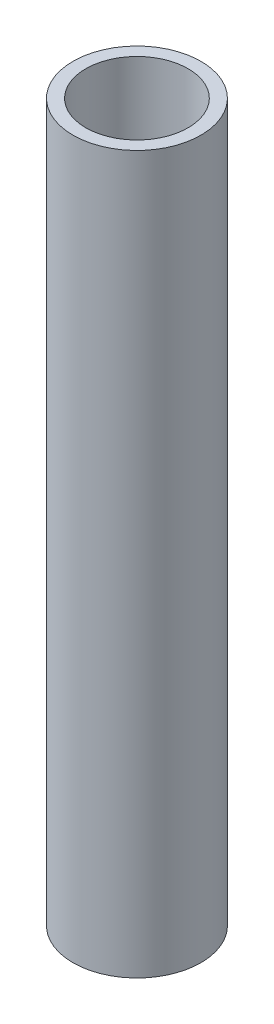
ISO-10303-21;
HEADER;
FILE_DESCRIPTION(('STEP AP214'),'2;1');
FILE_NAME('part.step','',(''),(''),'','','');
FILE_SCHEMA(('AUTOMOTIVE_DESIGN { 1 0 10303 214 1 1 1 1 }'));
ENDSEC;
DATA;
#1=APPLICATION_CONTEXT('core data for automotive mechanical design processes');
#2=APPLICATION_PROTOCOL_DEFINITION('international standard','automotive_design',2000,#1);
#3=PRODUCT_CONTEXT('',#1,'mechanical');
#4=PRODUCT('Part','Part','',(#3));
#5=PRODUCT_RELATED_PRODUCT_CATEGORY('part','',(#4));
#6=PRODUCT_DEFINITION_FORMATION('','',#4);
#7=PRODUCT_DEFINITION_CONTEXT('part definition',#1,'design');
#8=PRODUCT_DEFINITION('design','',#6,#7);
#9=PRODUCT_DEFINITION_SHAPE('','',#8);
#10=(LENGTH_UNIT() NAMED_UNIT(*) SI_UNIT(.MILLI.,.METRE.));
#11=(NAMED_UNIT(*) PLANE_ANGLE_UNIT() SI_UNIT($,.RADIAN.));
#12=(NAMED_UNIT(*) SI_UNIT($,.STERADIAN.) SOLID_ANGLE_UNIT());
#13=UNCERTAINTY_MEASURE_WITH_UNIT(LENGTH_MEASURE(1.E-05),#10,'distance_accuracy_value','');
#14=(GEOMETRIC_REPRESENTATION_CONTEXT(3) GLOBAL_UNCERTAINTY_ASSIGNED_CONTEXT((#13)) GLOBAL_UNIT_ASSIGNED_CONTEXT((#10,
#11,#12)) REPRESENTATION_CONTEXT('',''));
#15=CARTESIAN_POINT('',(0.,0.,0.));
#16=DIRECTION('',(0.,0.,1.));
#17=DIRECTION('',(1.,0.,0.));
#18=AXIS2_PLACEMENT_3D('',#15,#16,#17);
#19=CARTESIAN_POINT('',(0.,70.,0.));
#20=DIRECTION('',(0.,1.,0.));
#21=DIRECTION('',(0.,0.,1.));
#22=AXIS2_PLACEMENT_3D('',#19,#20,#21);
#23=PLANE('',#22);
#24=CARTESIAN_POINT('',(0.,70.,0.));
#25=DIRECTION('',(0.,1.,0.));
#26=DIRECTION('',(0.,0.,1.));
#27=AXIS2_PLACEMENT_3D('',#24,#25,#26);
#28=CIRCLE('',#27,12.5);
#29=CARTESIAN_POINT('',(0.,70.,12.5));
#30=VERTEX_POINT('',#29);
#31=EDGE_CURVE('E10',#30,#30,#28,.T.);
#32=ORIENTED_EDGE('',*,*,#31,.T.);
#33=EDGE_LOOP('',(#32));
#34=FACE_BOUND('',#33,.T.);
#35=CARTESIAN_POINT('',(0.,70.,0.));
#36=DIRECTION('',(0.,1.,0.));
#37=DIRECTION('',(0.,0.,1.));
#38=AXIS2_PLACEMENT_3D('',#35,#36,#37);
#39=CIRCLE('',#38,10.);
#40=CARTESIAN_POINT('',(0.,70.,10.));
#41=VERTEX_POINT('',#40);
#42=EDGE_CURVE('E46',#41,#41,#39,.T.);
#43=ORIENTED_EDGE('',*,*,#42,.F.);
#44=EDGE_LOOP('',(#43));
#45=FACE_BOUND('',#44,.T.);
#46=ADVANCED_FACE('F35',(#34,#45),#23,.T.);
#47=CARTESIAN_POINT('',(0.,-70.,0.));
#48=DIRECTION('',(0.,1.,0.));
#49=DIRECTION('',(0.,0.,1.));
#50=AXIS2_PLACEMENT_3D('',#47,#48,#49);
#51=PLANE('',#50);
#52=CARTESIAN_POINT('',(0.,-70.,0.));
#53=DIRECTION('',(0.,1.,0.));
#54=DIRECTION('',(0.,0.,1.));
#55=AXIS2_PLACEMENT_3D('',#52,#53,#54);
#56=CIRCLE('',#55,12.5);
#57=CARTESIAN_POINT('',(0.,-70.,12.5));
#58=VERTEX_POINT('',#57);
#59=EDGE_CURVE('E39',#58,#58,#56,.T.);
#60=ORIENTED_EDGE('',*,*,#59,.F.);
#61=EDGE_LOOP('',(#60));
#62=FACE_BOUND('',#61,.T.);
#63=CARTESIAN_POINT('',(0.,-70.,0.));
#64=DIRECTION('',(0.,1.,0.));
#65=DIRECTION('',(0.,0.,1.));
#66=AXIS2_PLACEMENT_3D('',#63,#64,#65);
#67=CIRCLE('',#66,10.);
#68=CARTESIAN_POINT('',(0.,-70.,10.));
#69=VERTEX_POINT('',#68);
#70=EDGE_CURVE('E48',#69,#69,#67,.T.);
#71=ORIENTED_EDGE('',*,*,#70,.T.);
#72=EDGE_LOOP('',(#71));
#73=FACE_BOUND('',#72,.T.);
#74=ADVANCED_FACE('F58',(#62,#73),#51,.F.);
#75=CARTESIAN_POINT('',(0.,70.,0.));
#76=DIRECTION('',(0.,-1.,0.));
#77=DIRECTION('',(0.,0.,-1.));
#78=AXIS2_PLACEMENT_3D('',#75,#76,#77);
#79=CYLINDRICAL_SURFACE('',#78,12.5);
#80=ORIENTED_EDGE('',*,*,#31,.F.);
#81=EDGE_LOOP('',(#80));
#82=FACE_BOUND('',#81,.T.);
#83=ORIENTED_EDGE('',*,*,#59,.T.);
#84=EDGE_LOOP('',(#83));
#85=FACE_BOUND('',#84,.T.);
#86=ADVANCED_FACE('F37',(#82,#85),#79,.T.);
#87=CARTESIAN_POINT('',(0.,70.,0.));
#88=DIRECTION('',(0.,-1.,0.));
#89=DIRECTION('',(0.,0.,-1.));
#90=AXIS2_PLACEMENT_3D('',#87,#88,#89);
#91=CYLINDRICAL_SURFACE('',#90,10.);
#92=ORIENTED_EDGE('',*,*,#42,.T.);
#93=EDGE_LOOP('',(#92));
#94=FACE_BOUND('',#93,.T.);
#95=ORIENTED_EDGE('',*,*,#70,.F.);
#96=EDGE_LOOP('',(#95));
#97=FACE_BOUND('',#96,.T.);
#98=ADVANCED_FACE('F54',(#94,#97),#91,.F.);
#99=CLOSED_SHELL('',(#46,#74,#86,#98));
#100=MANIFOLD_SOLID_BREP('B2',#99);
#101=ADVANCED_BREP_SHAPE_REPRESENTATION('',(#18,#100),#14);
#102=SHAPE_DEFINITION_REPRESENTATION(#9,#101);
ENDSEC;
END-ISO-10303-21;
